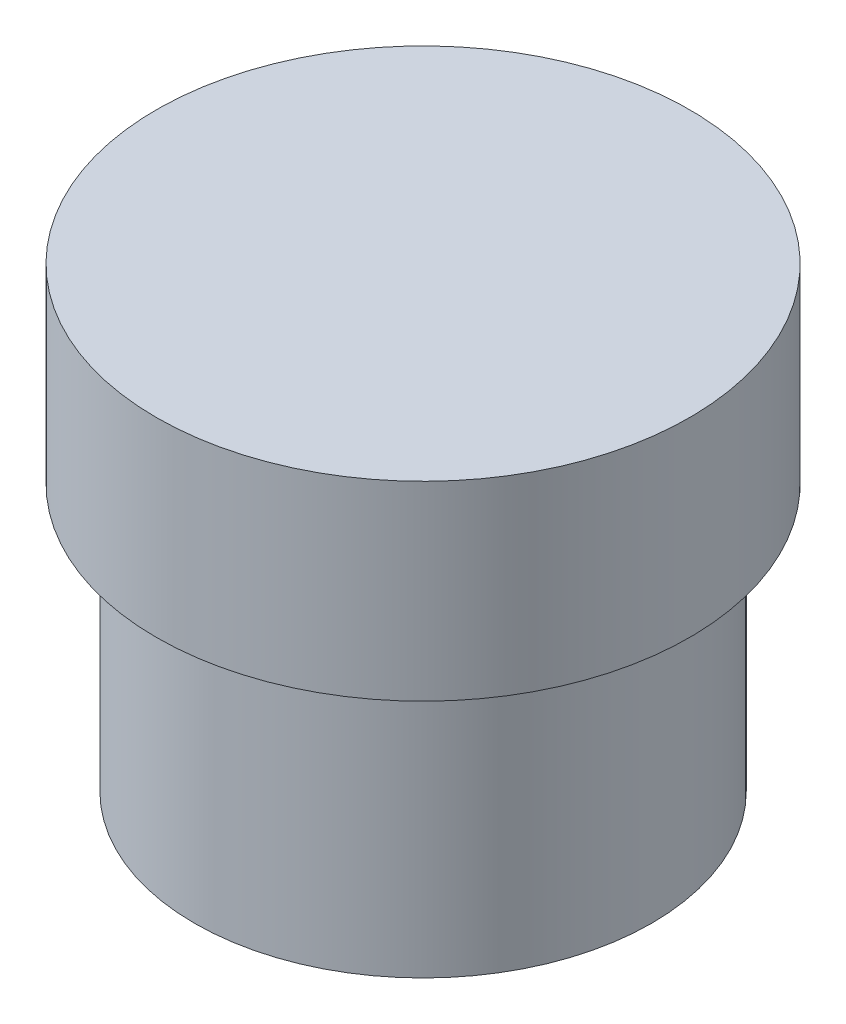
ISO-10303-21;
HEADER;
FILE_DESCRIPTION(('STEP AP214'),'2;1');
FILE_NAME('part.step','',(''),(''),'','','');
FILE_SCHEMA(('AUTOMOTIVE_DESIGN { 1 0 10303 214 1 1 1 1 }'));
ENDSEC;
DATA;
#1=APPLICATION_CONTEXT('core data for automotive mechanical design processes');
#2=APPLICATION_PROTOCOL_DEFINITION('international standard','automotive_design',2000,#1);
#3=PRODUCT_CONTEXT('',#1,'mechanical');
#4=PRODUCT('Part','Part','',(#3));
#5=PRODUCT_RELATED_PRODUCT_CATEGORY('part','',(#4));
#6=PRODUCT_DEFINITION_FORMATION('','',#4);
#7=PRODUCT_DEFINITION_CONTEXT('part definition',#1,'design');
#8=PRODUCT_DEFINITION('design','',#6,#7);
#9=PRODUCT_DEFINITION_SHAPE('','',#8);
#10=(LENGTH_UNIT() NAMED_UNIT(*) SI_UNIT(.MILLI.,.METRE.));
#11=(NAMED_UNIT(*) PLANE_ANGLE_UNIT() SI_UNIT($,.RADIAN.));
#12=(NAMED_UNIT(*) SI_UNIT($,.STERADIAN.) SOLID_ANGLE_UNIT());
#13=UNCERTAINTY_MEASURE_WITH_UNIT(LENGTH_MEASURE(1.E-05),#10,'distance_accuracy_value','');
#14=(GEOMETRIC_REPRESENTATION_CONTEXT(3) GLOBAL_UNCERTAINTY_ASSIGNED_CONTEXT((#13)) GLOBAL_UNIT_ASSIGNED_CONTEXT((#10,
#11,#12)) REPRESENTATION_CONTEXT('',''));
#15=CARTESIAN_POINT('',(0.,0.,0.));
#16=DIRECTION('',(0.,0.,1.));
#17=DIRECTION('',(1.,0.,0.));
#18=AXIS2_PLACEMENT_3D('',#15,#16,#17);
#19=CARTESIAN_POINT('',(0.,-5.,0.));
#20=DIRECTION('',(0.,1.,0.));
#21=DIRECTION('',(0.,0.,1.));
#22=AXIS2_PLACEMENT_3D('',#19,#20,#21);
#23=CYLINDRICAL_SURFACE('',#22,7.);
#24=CARTESIAN_POINT('',(0.,-5.,0.));
#25=DIRECTION('',(0.,1.,0.));
#26=DIRECTION('',(0.,0.,1.));
#27=AXIS2_PLACEMENT_3D('',#24,#25,#26);
#28=CIRCLE('',#27,7.);
#29=CARTESIAN_POINT('',(0.,-5.,7.));
#30=VERTEX_POINT('',#29);
#31=EDGE_CURVE('E45',#30,#30,#28,.T.);
#32=ORIENTED_EDGE('',*,*,#31,.T.);
#33=EDGE_LOOP('',(#32));
#34=FACE_BOUND('',#33,.T.);
#35=CARTESIAN_POINT('',(0.,0.,0.));
#36=DIRECTION('',(0.,1.,0.));
#37=DIRECTION('',(0.,0.,1.));
#38=AXIS2_PLACEMENT_3D('',#35,#36,#37);
#39=CIRCLE('',#38,7.);
#40=CARTESIAN_POINT('',(0.,0.,7.));
#41=VERTEX_POINT('',#40);
#42=EDGE_CURVE('E40',#41,#41,#39,.T.);
#43=ORIENTED_EDGE('',*,*,#42,.F.);
#44=EDGE_LOOP('',(#43));
#45=FACE_BOUND('',#44,.T.);
#46=ADVANCED_FACE('F37',(#34,#45),#23,.T.);
#47=CARTESIAN_POINT('',(0.,-5.,0.));
#48=DIRECTION('',(0.,1.,0.));
#49=DIRECTION('',(0.,0.,1.));
#50=AXIS2_PLACEMENT_3D('',#47,#48,#49);
#51=PLANE('',#50);
#52=CARTESIAN_POINT('',(0.,-5.,0.));
#53=DIRECTION('',(0.,-1.,0.));
#54=DIRECTION('',(0.,0.,-1.));
#55=AXIS2_PLACEMENT_3D('',#52,#53,#54);
#56=CIRCLE('',#55,6.);
#57=CARTESIAN_POINT('',(0.,-5.,-6.));
#58=VERTEX_POINT('',#57);
#59=EDGE_CURVE('E10',#58,#58,#56,.T.);
#60=ORIENTED_EDGE('',*,*,#59,.F.);
#61=EDGE_LOOP('',(#60));
#62=FACE_BOUND('',#61,.T.);
#63=ORIENTED_EDGE('',*,*,#31,.F.);
#64=EDGE_LOOP('',(#63));
#65=FACE_BOUND('',#64,.T.);
#66=ADVANCED_FACE('F64',(#62,#65),#51,.F.);
#67=CARTESIAN_POINT('',(0.,0.,0.));
#68=DIRECTION('',(0.,1.,0.));
#69=DIRECTION('',(0.,0.,1.));
#70=AXIS2_PLACEMENT_3D('',#67,#68,#69);
#71=PLANE('',#70);
#72=ORIENTED_EDGE('',*,*,#42,.T.);
#73=EDGE_LOOP('',(#72));
#74=FACE_BOUND('',#73,.T.);
#75=ADVANCED_FACE('F61',(#74),#71,.T.);
#76=CARTESIAN_POINT('',(0.,-12.,0.));
#77=DIRECTION('',(0.,1.,0.));
#78=DIRECTION('',(0.,0.,1.));
#79=AXIS2_PLACEMENT_3D('',#76,#77,#78);
#80=CYLINDRICAL_SURFACE('',#79,6.);
#81=CARTESIAN_POINT('',(0.,-12.,0.));
#82=DIRECTION('',(0.,-1.,0.));
#83=DIRECTION('',(0.,0.,-1.));
#84=AXIS2_PLACEMENT_3D('',#81,#82,#83);
#85=CIRCLE('',#84,6.);
#86=CARTESIAN_POINT('',(0.,-12.,-6.));
#87=VERTEX_POINT('',#86);
#88=EDGE_CURVE('E52',#87,#87,#85,.T.);
#89=ORIENTED_EDGE('',*,*,#88,.F.);
#90=EDGE_LOOP('',(#89));
#91=FACE_BOUND('',#90,.T.);
#92=ORIENTED_EDGE('',*,*,#59,.T.);
#93=EDGE_LOOP('',(#92));
#94=FACE_BOUND('',#93,.T.);
#95=ADVANCED_FACE('F78',(#91,#94),#80,.T.);
#96=CARTESIAN_POINT('',(0.,-12.,0.));
#97=DIRECTION('',(0.,-1.,0.));
#98=DIRECTION('',(0.,0.,-1.));
#99=AXIS2_PLACEMENT_3D('',#96,#97,#98);
#100=PLANE('',#99);
#101=ORIENTED_EDGE('',*,*,#88,.T.);
#102=EDGE_LOOP('',(#101));
#103=FACE_BOUND('',#102,.T.);
#104=ADVANCED_FACE('F82',(#103),#100,.T.);
#105=CLOSED_SHELL('',(#46,#66,#75,#95,#104));
#106=MANIFOLD_SOLID_BREP('B2',#105);
#107=ADVANCED_BREP_SHAPE_REPRESENTATION('',(#18,#106),#14);
#108=SHAPE_DEFINITION_REPRESENTATION(#9,#107);
ENDSEC;
END-ISO-10303-21;
